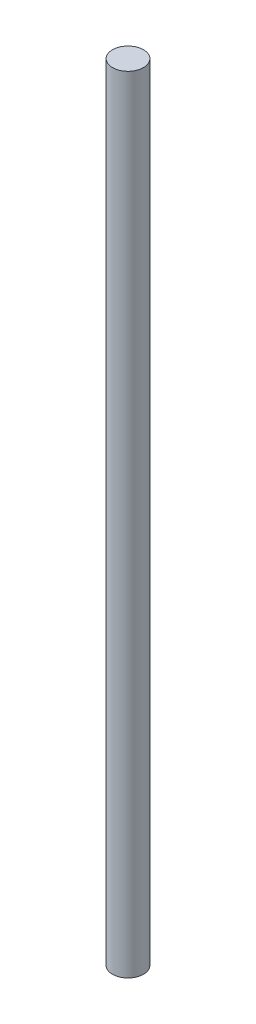
ISO-10303-21;
HEADER;
FILE_DESCRIPTION(('STEP AP214'),'2;1');
FILE_NAME('part.step','',(''),(''),'','','');
FILE_SCHEMA(('AUTOMOTIVE_DESIGN { 1 0 10303 214 1 1 1 1 }'));
ENDSEC;
DATA;
#1=APPLICATION_CONTEXT('core data for automotive mechanical design processes');
#2=APPLICATION_PROTOCOL_DEFINITION('international standard','automotive_design',2000,#1);
#3=PRODUCT_CONTEXT('',#1,'mechanical');
#4=PRODUCT('Part','Part','',(#3));
#5=PRODUCT_RELATED_PRODUCT_CATEGORY('part','',(#4));
#6=PRODUCT_DEFINITION_FORMATION('','',#4);
#7=PRODUCT_DEFINITION_CONTEXT('part definition',#1,'design');
#8=PRODUCT_DEFINITION('design','',#6,#7);
#9=PRODUCT_DEFINITION_SHAPE('','',#8);
#10=(LENGTH_UNIT() NAMED_UNIT(*) SI_UNIT(.MILLI.,.METRE.));
#11=(NAMED_UNIT(*) PLANE_ANGLE_UNIT() SI_UNIT($,.RADIAN.));
#12=(NAMED_UNIT(*) SI_UNIT($,.STERADIAN.) SOLID_ANGLE_UNIT());
#13=UNCERTAINTY_MEASURE_WITH_UNIT(LENGTH_MEASURE(1.E-05),#10,'distance_accuracy_value','');
#14=(GEOMETRIC_REPRESENTATION_CONTEXT(3) GLOBAL_UNCERTAINTY_ASSIGNED_CONTEXT((#13)) GLOBAL_UNIT_ASSIGNED_CONTEXT((#10,
#11,#12)) REPRESENTATION_CONTEXT('',''));
#15=CARTESIAN_POINT('',(0.,0.,0.));
#16=DIRECTION('',(0.,0.,1.));
#17=DIRECTION('',(1.,0.,0.));
#18=AXIS2_PLACEMENT_3D('',#15,#16,#17);
#19=CARTESIAN_POINT('',(0.,241.3,0.));
#20=DIRECTION('',(0.,-1.,0.));
#21=DIRECTION('',(0.,0.,-1.));
#22=AXIS2_PLACEMENT_3D('',#19,#20,#21);
#23=CYLINDRICAL_SURFACE('',#22,4.7625);
#24=CARTESIAN_POINT('',(0.,241.3,0.));
#25=DIRECTION('',(0.,1.,0.));
#26=DIRECTION('',(0.,0.,1.));
#27=AXIS2_PLACEMENT_3D('',#24,#25,#26);
#28=CIRCLE('',#27,4.7625);
#29=CARTESIAN_POINT('',(0.,241.3,4.7625));
#30=VERTEX_POINT('',#29);
#31=EDGE_CURVE('E10',#30,#30,#28,.T.);
#32=ORIENTED_EDGE('',*,*,#31,.F.);
#33=EDGE_LOOP('',(#32));
#34=FACE_BOUND('',#33,.T.);
#35=CARTESIAN_POINT('',(0.,0.,0.));
#36=DIRECTION('',(0.,1.,0.));
#37=DIRECTION('',(0.,0.,1.));
#38=AXIS2_PLACEMENT_3D('',#35,#36,#37);
#39=CIRCLE('',#38,4.7625);
#40=CARTESIAN_POINT('',(0.,0.,4.7625));
#41=VERTEX_POINT('',#40);
#42=EDGE_CURVE('E32',#41,#41,#39,.T.);
#43=ORIENTED_EDGE('',*,*,#42,.T.);
#44=EDGE_LOOP('',(#43));
#45=FACE_BOUND('',#44,.T.);
#46=ADVANCED_FACE('F29',(#34,#45),#23,.T.);
#47=CARTESIAN_POINT('',(0.,241.3,0.));
#48=DIRECTION('',(0.,1.,0.));
#49=DIRECTION('',(0.,0.,1.));
#50=AXIS2_PLACEMENT_3D('',#47,#48,#49);
#51=PLANE('',#50);
#52=ORIENTED_EDGE('',*,*,#31,.T.);
#53=EDGE_LOOP('',(#52));
#54=FACE_BOUND('',#53,.T.);
#55=ADVANCED_FACE('F44',(#54),#51,.T.);
#56=CARTESIAN_POINT('',(0.,0.,0.));
#57=DIRECTION('',(0.,1.,0.));
#58=DIRECTION('',(0.,0.,1.));
#59=AXIS2_PLACEMENT_3D('',#56,#57,#58);
#60=PLANE('',#59);
#61=ORIENTED_EDGE('',*,*,#42,.F.);
#62=EDGE_LOOP('',(#61));
#63=FACE_BOUND('',#62,.T.);
#64=ADVANCED_FACE('F42',(#63),#60,.F.);
#65=CLOSED_SHELL('',(#46,#55,#64));
#66=MANIFOLD_SOLID_BREP('B2',#65);
#67=ADVANCED_BREP_SHAPE_REPRESENTATION('',(#18,#66),#14);
#68=SHAPE_DEFINITION_REPRESENTATION(#9,#67);
ENDSEC;
END-ISO-10303-21;
